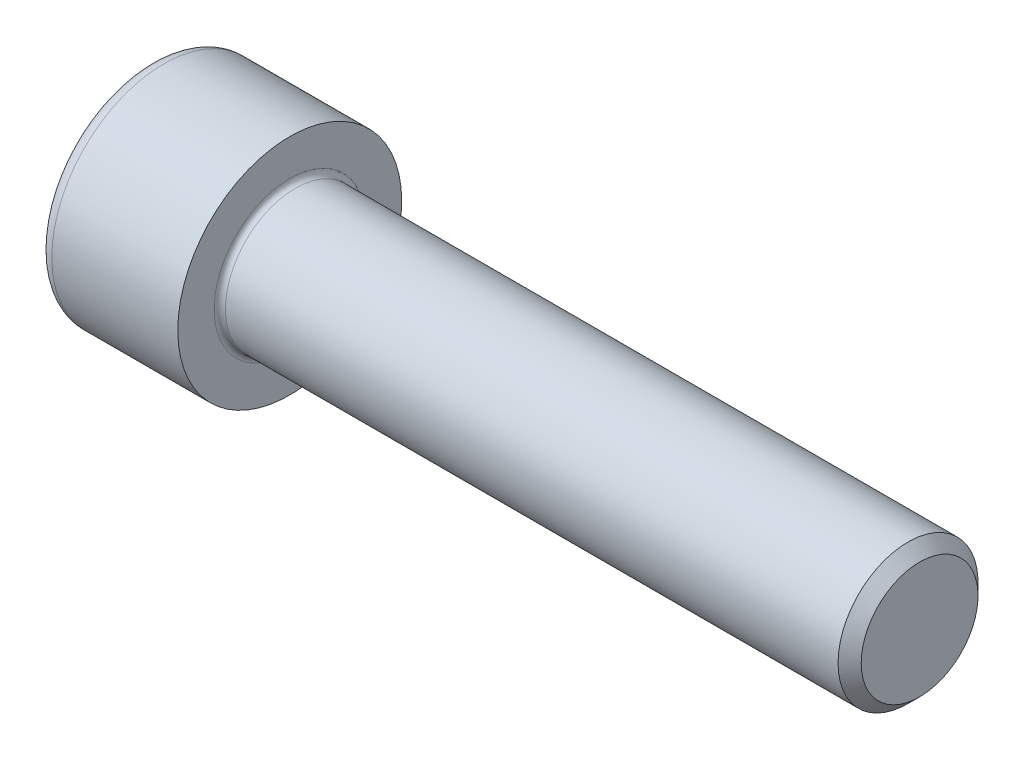
ISO-10303-21;
HEADER;
FILE_DESCRIPTION(('STEP AP214'),'2;1');
FILE_NAME('part.step','',(''),(''),'','','');
FILE_SCHEMA(('AUTOMOTIVE_DESIGN { 1 0 10303 214 1 1 1 1 }'));
ENDSEC;
DATA;
#1=APPLICATION_CONTEXT('core data for automotive mechanical design processes');
#2=APPLICATION_PROTOCOL_DEFINITION('international standard','automotive_design',2000,#1);
#3=PRODUCT_CONTEXT('',#1,'mechanical');
#4=PRODUCT('Part','Part','',(#3));
#5=PRODUCT_RELATED_PRODUCT_CATEGORY('part','',(#4));
#6=PRODUCT_DEFINITION_FORMATION('','',#4);
#7=PRODUCT_DEFINITION_CONTEXT('part definition',#1,'design');
#8=PRODUCT_DEFINITION('design','',#6,#7);
#9=PRODUCT_DEFINITION_SHAPE('','',#8);
#10=(LENGTH_UNIT() NAMED_UNIT(*) SI_UNIT(.MILLI.,.METRE.));
#11=(NAMED_UNIT(*) PLANE_ANGLE_UNIT() SI_UNIT($,.RADIAN.));
#12=(NAMED_UNIT(*) SI_UNIT($,.STERADIAN.) SOLID_ANGLE_UNIT());
#13=UNCERTAINTY_MEASURE_WITH_UNIT(LENGTH_MEASURE(1.E-05),#10,'distance_accuracy_value','');
#14=(GEOMETRIC_REPRESENTATION_CONTEXT(3) GLOBAL_UNCERTAINTY_ASSIGNED_CONTEXT((#13)) GLOBAL_UNIT_ASSIGNED_CONTEXT((#10,
#11,#12)) REPRESENTATION_CONTEXT('',''));
#15=CARTESIAN_POINT('',(0.,0.,0.));
#16=DIRECTION('',(0.,0.,1.));
#17=DIRECTION('',(1.,0.,0.));
#18=AXIS2_PLACEMENT_3D('',#15,#16,#17);
#19=CARTESIAN_POINT('',(0.,0.,0.));
#20=DIRECTION('',(-1.,0.,0.));
#21=DIRECTION('',(0.,0.,1.));
#22=AXIS2_PLACEMENT_3D('',#19,#20,#21);
#23=PLANE('',#22);
#24=DIRECTION('',(0.,-0.499999999999999,0.866025403784439));
#25=VECTOR('',#24,1.);
#26=CARTESIAN_POINT('',(0.,4.63323591024674,0.));
#27=LINE('',#26,#25);
#28=CARTESIAN_POINT('',(0.,4.63323591024674,0.));
#29=VERTEX_POINT('',#28);
#30=CARTESIAN_POINT('',(0.,2.31661795512337,4.0125));
#31=VERTEX_POINT('',#30);
#32=EDGE_CURVE('E265',#29,#31,#27,.T.);
#33=ORIENTED_EDGE('',*,*,#32,.T.);
#34=DIRECTION('',(0.,1.,0.));
#35=VECTOR('',#34,1.);
#36=CARTESIAN_POINT('',(0.,-2.31661795512337,4.0125));
#37=LINE('',#36,#35);
#38=CARTESIAN_POINT('',(0.,-2.31661795512337,4.0125));
#39=VERTEX_POINT('',#38);
#40=EDGE_CURVE('E126',#39,#31,#37,.T.);
#41=ORIENTED_EDGE('',*,*,#40,.F.);
#42=DIRECTION('',(0.,-0.500000000000001,-0.866025403784438));
#43=VECTOR('',#42,1.);
#44=CARTESIAN_POINT('',(0.,-2.31661795512337,4.0125));
#45=LINE('',#44,#43);
#46=CARTESIAN_POINT('',(0.,-4.63323591024675,0.));
#47=VERTEX_POINT('',#46);
#48=EDGE_CURVE('E268',#39,#47,#45,.T.);
#49=ORIENTED_EDGE('',*,*,#48,.T.);
#50=DIRECTION('',(0.,0.499999999999999,-0.866025403784439));
#51=VECTOR('',#50,1.);
#52=CARTESIAN_POINT('',(0.,-4.63323591024675,0.));
#53=LINE('',#52,#51);
#54=CARTESIAN_POINT('',(0.,-2.31661795512338,-4.0125));
#55=VERTEX_POINT('',#54);
#56=EDGE_CURVE('E271',#47,#55,#53,.T.);
#57=ORIENTED_EDGE('',*,*,#56,.T.);
#58=DIRECTION('',(0.,-1.,0.));
#59=VECTOR('',#58,1.);
#60=CARTESIAN_POINT('',(0.,2.31661795512336,-4.0125));
#61=LINE('',#60,#59);
#62=CARTESIAN_POINT('',(0.,2.31661795512336,-4.0125));
#63=VERTEX_POINT('',#62);
#64=EDGE_CURVE('E274',#63,#55,#61,.T.);
#65=ORIENTED_EDGE('',*,*,#64,.F.);
#66=DIRECTION('',(0.,-0.500000000000001,-0.866025403784438));
#67=VECTOR('',#66,1.);
#68=CARTESIAN_POINT('',(0.,4.63323591024674,0.));
#69=LINE('',#68,#67);
#70=EDGE_CURVE('E121',#29,#63,#69,.T.);
#71=ORIENTED_EDGE('',*,*,#70,.F.);
#72=EDGE_LOOP('',(#33,#41,#49,#57,#65,#71));
#73=FACE_BOUND('',#72,.T.);
#74=CARTESIAN_POINT('',(0.,0.,0.));
#75=DIRECTION('',(-1.,0.,0.));
#76=DIRECTION('',(0.,0.,1.));
#77=AXIS2_PLACEMENT_3D('',#74,#75,#76);
#78=CIRCLE('',#77,7.);
#79=CARTESIAN_POINT('',(0.,0.,7.));
#80=VERTEX_POINT('',#79);
#81=EDGE_CURVE('E42',#80,#80,#78,.T.);
#82=ORIENTED_EDGE('',*,*,#81,.T.);
#83=EDGE_LOOP('',(#82));
#84=FACE_BOUND('',#83,.T.);
#85=ADVANCED_FACE('F34',(#73,#84),#23,.T.);
#86=CARTESIAN_POINT('',(-31.75,0.,0.));
#87=DIRECTION('',(-1.,0.,0.));
#88=DIRECTION('',(0.,0.,1.));
#89=AXIS2_PLACEMENT_3D('',#86,#87,#88);
#90=CYLINDRICAL_SURFACE('',#89,8.);
#91=CARTESIAN_POINT('',(1.,0.,0.));
#92=DIRECTION('',(-1.,0.,0.));
#93=DIRECTION('',(0.,0.,1.));
#94=AXIS2_PLACEMENT_3D('',#91,#92,#93);
#95=CIRCLE('',#94,8.);
#96=CARTESIAN_POINT('',(1.,0.,8.));
#97=VERTEX_POINT('',#96);
#98=EDGE_CURVE('E11',#97,#97,#95,.F.);
#99=ORIENTED_EDGE('',*,*,#98,.T.);
#100=EDGE_LOOP('',(#99));
#101=FACE_BOUND('',#100,.T.);
#102=CARTESIAN_POINT('',(10.,0.,0.));
#103=DIRECTION('',(-1.,0.,0.));
#104=DIRECTION('',(0.,0.,1.));
#105=AXIS2_PLACEMENT_3D('',#102,#103,#104);
#106=CIRCLE('',#105,8.);
#107=CARTESIAN_POINT('',(10.,0.,8.));
#108=VERTEX_POINT('',#107);
#109=EDGE_CURVE('E144',#108,#108,#106,.T.);
#110=ORIENTED_EDGE('',*,*,#109,.T.);
#111=EDGE_LOOP('',(#110));
#112=FACE_BOUND('',#111,.T.);
#113=ADVANCED_FACE('F168',(#101,#112),#90,.T.);
#114=CARTESIAN_POINT('',(10.,8.,0.));
#115=DIRECTION('',(1.,0.,0.));
#116=DIRECTION('',(0.,0.,-1.));
#117=AXIS2_PLACEMENT_3D('',#114,#115,#116);
#118=PLANE('',#117);
#119=CARTESIAN_POINT('',(10.,0.,0.));
#120=DIRECTION('',(1.,0.,0.));
#121=DIRECTION('',(0.,0.,-1.));
#122=AXIS2_PLACEMENT_3D('',#119,#120,#121);
#123=CIRCLE('',#122,5.4);
#124=CARTESIAN_POINT('',(10.,0.,-5.4));
#125=VERTEX_POINT('',#124);
#126=EDGE_CURVE('E147',#125,#125,#123,.F.);
#127=ORIENTED_EDGE('',*,*,#126,.T.);
#128=EDGE_LOOP('',(#127));
#129=FACE_BOUND('',#128,.T.);
#130=ORIENTED_EDGE('',*,*,#109,.F.);
#131=EDGE_LOOP('',(#130));
#132=FACE_BOUND('',#131,.T.);
#133=ADVANCED_FACE('F174',(#129,#132),#118,.T.);
#134=CARTESIAN_POINT('',(-31.75,0.,0.));
#135=DIRECTION('',(-1.,0.,0.));
#136=DIRECTION('',(0.,0.,1.));
#137=AXIS2_PLACEMENT_3D('',#134,#135,#136);
#138=CYLINDRICAL_SURFACE('',#137,5.);
#139=CARTESIAN_POINT('',(10.4,0.,0.));
#140=DIRECTION('',(1.,0.,0.));
#141=DIRECTION('',(0.,0.,-1.));
#142=AXIS2_PLACEMENT_3D('',#139,#140,#141);
#143=CIRCLE('',#142,5.);
#144=CARTESIAN_POINT('',(10.4,0.,-5.));
#145=VERTEX_POINT('',#144);
#146=EDGE_CURVE('E150',#145,#145,#143,.T.);
#147=ORIENTED_EDGE('',*,*,#146,.T.);
#148=EDGE_LOOP('',(#147));
#149=FACE_BOUND('',#148,.T.);
#150=CARTESIAN_POINT('',(54.172,0.,0.));
#151=DIRECTION('',(-1.,0.,0.));
#152=DIRECTION('',(0.,0.,1.));
#153=AXIS2_PLACEMENT_3D('',#150,#151,#152);
#154=CIRCLE('',#153,5.);
#155=CARTESIAN_POINT('',(54.172,0.,5.));
#156=VERTEX_POINT('',#155);
#157=EDGE_CURVE('E141',#156,#156,#154,.T.);
#158=ORIENTED_EDGE('',*,*,#157,.T.);
#159=EDGE_LOOP('',(#158));
#160=FACE_BOUND('',#159,.T.);
#161=ADVANCED_FACE('F180',(#149,#160),#138,.T.);
#162=CARTESIAN_POINT('',(55.,0.,0.));
#163=DIRECTION('',(-1.,0.,0.));
#164=DIRECTION('',(0.,0.,1.));
#165=AXIS2_PLACEMENT_3D('',#162,#163,#164);
#166=CONICAL_SURFACE('',#165,4.172,0.785398163397434);
#167=ORIENTED_EDGE('',*,*,#157,.F.);
#168=EDGE_LOOP('',(#167));
#169=FACE_BOUND('',#168,.T.);
#170=CARTESIAN_POINT('',(55.,0.,0.));
#171=DIRECTION('',(-1.,0.,0.));
#172=DIRECTION('',(0.,0.,1.));
#173=AXIS2_PLACEMENT_3D('',#170,#171,#172);
#174=CIRCLE('',#173,4.172);
#175=CARTESIAN_POINT('',(55.,0.,4.172));
#176=VERTEX_POINT('',#175);
#177=EDGE_CURVE('E137',#176,#176,#174,.T.);
#178=ORIENTED_EDGE('',*,*,#177,.T.);
#179=EDGE_LOOP('',(#178));
#180=FACE_BOUND('',#179,.T.);
#181=ADVANCED_FACE('F184',(#169,#180),#166,.T.);
#182=CARTESIAN_POINT('',(55.,4.172,0.));
#183=DIRECTION('',(1.,0.,0.));
#184=DIRECTION('',(0.,0.,-1.));
#185=AXIS2_PLACEMENT_3D('',#182,#183,#184);
#186=PLANE('',#185);
#187=ORIENTED_EDGE('',*,*,#177,.F.);
#188=EDGE_LOOP('',(#187));
#189=FACE_BOUND('',#188,.T.);
#190=ADVANCED_FACE('F164',(#189),#186,.T.);
#191=CARTESIAN_POINT('',(10.4,0.,0.));
#192=DIRECTION('',(1.,0.,0.));
#193=DIRECTION('',(0.,0.,-1.));
#194=AXIS2_PLACEMENT_3D('',#191,#192,#193);
#195=TOROIDAL_SURFACE('',#194,5.4,0.4);
#196=ORIENTED_EDGE('',*,*,#146,.F.);
#197=EDGE_LOOP('',(#196));
#198=FACE_BOUND('',#197,.T.);
#199=ORIENTED_EDGE('',*,*,#126,.F.);
#200=EDGE_LOOP('',(#199));
#201=FACE_BOUND('',#200,.T.);
#202=ADVANCED_FACE('F157',(#198,#201),#195,.F.);
#203=CARTESIAN_POINT('',(1.,0.,0.));
#204=DIRECTION('',(-1.,0.,0.));
#205=DIRECTION('',(0.,0.,1.));
#206=AXIS2_PLACEMENT_3D('',#203,#204,#205);
#207=TOROIDAL_SURFACE('',#206,7.,1.);
#208=ORIENTED_EDGE('',*,*,#98,.F.);
#209=EDGE_LOOP('',(#208));
#210=FACE_BOUND('',#209,.T.);
#211=ORIENTED_EDGE('',*,*,#81,.F.);
#212=EDGE_LOOP('',(#211));
#213=FACE_BOUND('',#212,.T.);
#214=ADVANCED_FACE('F36',(#210,#213),#207,.T.);
#215=CARTESIAN_POINT('',(5.,4.63323591024674,0.));
#216=DIRECTION('',(0.,-0.866025403784439,-0.499999999999999));
#217=DIRECTION('',(0.,0.499999999999999,-0.866025403784439));
#218=AXIS2_PLACEMENT_3D('',#215,#216,#217);
#219=PLANE('',#218);
#220=ORIENTED_EDGE('',*,*,#32,.F.);
#221=DIRECTION('',(-1.,0.,0.));
#222=VECTOR('',#221,1.);
#223=CARTESIAN_POINT('',(5.,4.63323591024674,0.));
#224=LINE('',#223,#222);
#225=CARTESIAN_POINT('',(5.,4.63323591024674,0.));
#226=VERTEX_POINT('',#225);
#227=EDGE_CURVE('E264',#226,#29,#224,.T.);
#228=ORIENTED_EDGE('',*,*,#227,.F.);
#229=DIRECTION('',(0.,-0.499999999999999,0.866025403784439));
#230=VECTOR('',#229,1.);
#231=CARTESIAN_POINT('',(5.,4.63323591024674,0.));
#232=LINE('',#231,#230);
#233=CARTESIAN_POINT('',(5.,3.47492693268506,2.00624999999999));
#234=VERTEX_POINT('',#233);
#235=EDGE_CURVE('E49',#226,#234,#232,.T.);
#236=ORIENTED_EDGE('',*,*,#235,.T.);
#237=CARTESIAN_POINT('',(5.,2.31661795512337,4.0125));
#238=VERTEX_POINT('',#237);
#239=EDGE_CURVE('E107',#234,#238,#232,.T.);
#240=ORIENTED_EDGE('',*,*,#239,.T.);
#241=DIRECTION('',(-1.,0.,0.));
#242=VECTOR('',#241,1.);
#243=CARTESIAN_POINT('',(5.,2.31661795512337,4.0125));
#244=LINE('',#243,#242);
#245=EDGE_CURVE('E119',#238,#31,#244,.T.);
#246=ORIENTED_EDGE('',*,*,#245,.T.);
#247=EDGE_LOOP('',(#220,#228,#236,#240,#246));
#248=FACE_BOUND('',#247,.T.);
#249=ADVANCED_FACE('F118',(#248),#219,.T.);
#250=CARTESIAN_POINT('',(5.,-2.31661795512337,4.0125));
#251=DIRECTION('',(0.,0.,1.));
#252=DIRECTION('',(0.,-1.,0.));
#253=AXIS2_PLACEMENT_3D('',#250,#251,#252);
#254=PLANE('',#253);
#255=ORIENTED_EDGE('',*,*,#40,.T.);
#256=ORIENTED_EDGE('',*,*,#245,.F.);
#257=DIRECTION('',(0.,1.,0.));
#258=VECTOR('',#257,1.);
#259=CARTESIAN_POINT('',(5.,-2.31661795512337,4.0125));
#260=LINE('',#259,#258);
#261=CARTESIAN_POINT('',(5.,0.,4.0125));
#262=VERTEX_POINT('',#261);
#263=EDGE_CURVE('E105',#262,#238,#260,.T.);
#264=ORIENTED_EDGE('',*,*,#263,.F.);
#265=CARTESIAN_POINT('',(5.,-2.31661795512337,4.0125));
#266=VERTEX_POINT('',#265);
#267=EDGE_CURVE('E115',#266,#262,#260,.T.);
#268=ORIENTED_EDGE('',*,*,#267,.F.);
#269=DIRECTION('',(-1.,0.,0.));
#270=VECTOR('',#269,1.);
#271=CARTESIAN_POINT('',(5.,-2.31661795512337,4.0125));
#272=LINE('',#271,#270);
#273=EDGE_CURVE('E128',#266,#39,#272,.T.);
#274=ORIENTED_EDGE('',*,*,#273,.T.);
#275=EDGE_LOOP('',(#255,#256,#264,#268,#274));
#276=FACE_BOUND('',#275,.T.);
#277=ADVANCED_FACE('F123',(#276),#254,.F.);
#278=CARTESIAN_POINT('',(5.,-2.31661795512337,4.0125));
#279=DIRECTION('',(0.,0.866025403784438,-0.500000000000001));
#280=DIRECTION('',(0.,0.500000000000001,0.866025403784438));
#281=AXIS2_PLACEMENT_3D('',#278,#279,#280);
#282=PLANE('',#281);
#283=ORIENTED_EDGE('',*,*,#48,.F.);
#284=ORIENTED_EDGE('',*,*,#273,.F.);
#285=DIRECTION('',(0.,-0.500000000000001,-0.866025403784438));
#286=VECTOR('',#285,1.);
#287=CARTESIAN_POINT('',(5.,-2.31661795512337,4.0125));
#288=LINE('',#287,#286);
#289=CARTESIAN_POINT('',(5.,-3.47492693268506,2.00625000000001));
#290=VERTEX_POINT('',#289);
#291=EDGE_CURVE('E245',#266,#290,#288,.T.);
#292=ORIENTED_EDGE('',*,*,#291,.T.);
#293=CARTESIAN_POINT('',(5.,-4.63323591024675,0.));
#294=VERTEX_POINT('',#293);
#295=EDGE_CURVE('E247',#290,#294,#288,.T.);
#296=ORIENTED_EDGE('',*,*,#295,.T.);
#297=DIRECTION('',(-1.,0.,0.));
#298=VECTOR('',#297,1.);
#299=CARTESIAN_POINT('',(5.,-4.63323591024675,0.));
#300=LINE('',#299,#298);
#301=EDGE_CURVE('E133',#294,#47,#300,.T.);
#302=ORIENTED_EDGE('',*,*,#301,.T.);
#303=EDGE_LOOP('',(#283,#284,#292,#296,#302));
#304=FACE_BOUND('',#303,.T.);
#305=ADVANCED_FACE('F197',(#304),#282,.T.);
#306=CARTESIAN_POINT('',(5.,-4.63323591024675,0.));
#307=DIRECTION('',(0.,0.866025403784439,0.499999999999999));
#308=DIRECTION('',(0.,-0.499999999999999,0.866025403784439));
#309=AXIS2_PLACEMENT_3D('',#306,#307,#308);
#310=PLANE('',#309);
#311=ORIENTED_EDGE('',*,*,#56,.F.);
#312=ORIENTED_EDGE('',*,*,#301,.F.);
#313=DIRECTION('',(0.,0.499999999999999,-0.866025403784439));
#314=VECTOR('',#313,1.);
#315=CARTESIAN_POINT('',(5.,-4.63323591024675,0.));
#316=LINE('',#315,#314);
#317=CARTESIAN_POINT('',(5.,-3.47492693268507,-2.00625));
#318=VERTEX_POINT('',#317);
#319=EDGE_CURVE('E250',#294,#318,#316,.T.);
#320=ORIENTED_EDGE('',*,*,#319,.T.);
#321=CARTESIAN_POINT('',(5.,-2.31661795512338,-4.0125));
#322=VERTEX_POINT('',#321);
#323=EDGE_CURVE('E254',#318,#322,#316,.T.);
#324=ORIENTED_EDGE('',*,*,#323,.T.);
#325=DIRECTION('',(-1.,0.,0.));
#326=VECTOR('',#325,1.);
#327=CARTESIAN_POINT('',(5.,-2.31661795512338,-4.0125));
#328=LINE('',#327,#326);
#329=EDGE_CURVE('E283',#322,#55,#328,.T.);
#330=ORIENTED_EDGE('',*,*,#329,.T.);
#331=EDGE_LOOP('',(#311,#312,#320,#324,#330));
#332=FACE_BOUND('',#331,.T.);
#333=ADVANCED_FACE('F200',(#332),#310,.T.);
#334=CARTESIAN_POINT('',(5.,2.31661795512336,-4.0125));
#335=DIRECTION('',(0.,0.,-1.));
#336=DIRECTION('',(0.,1.,0.));
#337=AXIS2_PLACEMENT_3D('',#334,#335,#336);
#338=PLANE('',#337);
#339=ORIENTED_EDGE('',*,*,#64,.T.);
#340=ORIENTED_EDGE('',*,*,#329,.F.);
#341=DIRECTION('',(0.,-1.,0.));
#342=VECTOR('',#341,1.);
#343=CARTESIAN_POINT('',(5.,2.31661795512336,-4.0125));
#344=LINE('',#343,#342);
#345=CARTESIAN_POINT('',(5.,0.,-4.0125));
#346=VERTEX_POINT('',#345);
#347=EDGE_CURVE('E258',#346,#322,#344,.T.);
#348=ORIENTED_EDGE('',*,*,#347,.F.);
#349=CARTESIAN_POINT('',(5.,2.31661795512336,-4.0125));
#350=VERTEX_POINT('',#349);
#351=EDGE_CURVE('E259',#350,#346,#344,.T.);
#352=ORIENTED_EDGE('',*,*,#351,.F.);
#353=DIRECTION('',(-1.,0.,0.));
#354=VECTOR('',#353,1.);
#355=CARTESIAN_POINT('',(5.,2.31661795512336,-4.0125));
#356=LINE('',#355,#354);
#357=EDGE_CURVE('E280',#350,#63,#356,.T.);
#358=ORIENTED_EDGE('',*,*,#357,.T.);
#359=EDGE_LOOP('',(#339,#340,#348,#352,#358));
#360=FACE_BOUND('',#359,.T.);
#361=ADVANCED_FACE('F204',(#360),#338,.F.);
#362=CARTESIAN_POINT('',(5.,4.63323591024674,0.));
#363=DIRECTION('',(0.,0.866025403784438,-0.500000000000001));
#364=DIRECTION('',(0.,0.500000000000001,0.866025403784438));
#365=AXIS2_PLACEMENT_3D('',#362,#363,#364);
#366=PLANE('',#365);
#367=ORIENTED_EDGE('',*,*,#70,.T.);
#368=ORIENTED_EDGE('',*,*,#357,.F.);
#369=DIRECTION('',(0.,-0.500000000000001,-0.866025403784438));
#370=VECTOR('',#369,1.);
#371=CARTESIAN_POINT('',(5.,4.63323591024674,0.));
#372=LINE('',#371,#370);
#373=CARTESIAN_POINT('',(5.,3.47492693268505,-2.00625));
#374=VERTEX_POINT('',#373);
#375=EDGE_CURVE('E262',#374,#350,#372,.T.);
#376=ORIENTED_EDGE('',*,*,#375,.F.);
#377=EDGE_CURVE('E236',#226,#374,#372,.T.);
#378=ORIENTED_EDGE('',*,*,#377,.F.);
#379=ORIENTED_EDGE('',*,*,#227,.T.);
#380=EDGE_LOOP('',(#367,#368,#376,#378,#379));
#381=FACE_BOUND('',#380,.T.);
#382=ADVANCED_FACE('F208',(#381),#366,.F.);
#383=CARTESIAN_POINT('',(5.,2.31661795512337,4.0125));
#384=DIRECTION('',(-1.,0.,0.));
#385=DIRECTION('',(0.,0.,1.));
#386=AXIS2_PLACEMENT_3D('',#383,#384,#385);
#387=PLANE('',#386);
#388=CARTESIAN_POINT('',(5.,0.,0.));
#389=DIRECTION('',(-1.,0.,0.));
#390=DIRECTION('',(0.,0.,1.));
#391=AXIS2_PLACEMENT_3D('',#388,#389,#390);
#392=CIRCLE('',#391,4.0125);
#393=EDGE_CURVE('E127',#290,#262,#392,.T.);
#394=ORIENTED_EDGE('',*,*,#393,.F.);
#395=ORIENTED_EDGE('',*,*,#291,.F.);
#396=ORIENTED_EDGE('',*,*,#267,.T.);
#397=EDGE_LOOP('',(#394,#395,#396));
#398=FACE_BOUND('',#397,.T.);
#399=ADVANCED_FACE('F212',(#398),#387,.T.);
#400=EDGE_CURVE('E131',#318,#290,#392,.T.);
#401=ORIENTED_EDGE('',*,*,#400,.F.);
#402=ORIENTED_EDGE('',*,*,#319,.F.);
#403=ORIENTED_EDGE('',*,*,#295,.F.);
#404=EDGE_LOOP('',(#401,#402,#403));
#405=FACE_BOUND('',#404,.T.);
#406=ADVANCED_FACE('F215',(#405),#387,.T.);
#407=EDGE_CURVE('E289',#346,#318,#392,.T.);
#408=ORIENTED_EDGE('',*,*,#407,.F.);
#409=ORIENTED_EDGE('',*,*,#347,.T.);
#410=ORIENTED_EDGE('',*,*,#323,.F.);
#411=EDGE_LOOP('',(#408,#409,#410));
#412=FACE_BOUND('',#411,.T.);
#413=ADVANCED_FACE('F220',(#412),#387,.T.);
#414=EDGE_CURVE('E239',#374,#346,#392,.T.);
#415=ORIENTED_EDGE('',*,*,#414,.F.);
#416=ORIENTED_EDGE('',*,*,#375,.T.);
#417=ORIENTED_EDGE('',*,*,#351,.T.);
#418=EDGE_LOOP('',(#415,#416,#417));
#419=FACE_BOUND('',#418,.T.);
#420=ADVANCED_FACE('F227',(#419),#387,.T.);
#421=EDGE_CURVE('E138',#234,#374,#392,.T.);
#422=ORIENTED_EDGE('',*,*,#421,.F.);
#423=ORIENTED_EDGE('',*,*,#235,.F.);
#424=ORIENTED_EDGE('',*,*,#377,.T.);
#425=EDGE_LOOP('',(#422,#423,#424));
#426=FACE_BOUND('',#425,.T.);
#427=ADVANCED_FACE('F223',(#426),#387,.T.);
#428=EDGE_CURVE('E110',#262,#234,#392,.T.);
#429=ORIENTED_EDGE('',*,*,#428,.F.);
#430=ORIENTED_EDGE('',*,*,#263,.T.);
#431=ORIENTED_EDGE('',*,*,#239,.F.);
#432=EDGE_LOOP('',(#429,#430,#431));
#433=FACE_BOUND('',#432,.T.);
#434=ADVANCED_FACE('F106',(#433),#387,.T.);
#435=CARTESIAN_POINT('',(5.,0.,0.));
#436=DIRECTION('',(-1.,0.,0.));
#437=DIRECTION('',(0.,0.,1.));
#438=AXIS2_PLACEMENT_3D('',#435,#436,#437);
#439=CONICAL_SURFACE('',#438,4.0125,1.04719755119659);
#440=CARTESIAN_POINT('',(7.31661795512339,0.,0.));
#441=VERTEX_POINT('',#440);
#442=VERTEX_LOOP('',#441);
#443=FACE_BOUND('',#442,.T.);
#444=ORIENTED_EDGE('',*,*,#428,.T.);
#445=ORIENTED_EDGE('',*,*,#421,.T.);
#446=ORIENTED_EDGE('',*,*,#414,.T.);
#447=ORIENTED_EDGE('',*,*,#407,.T.);
#448=ORIENTED_EDGE('',*,*,#400,.T.);
#449=ORIENTED_EDGE('',*,*,#393,.T.);
#450=EDGE_LOOP('',(#444,#445,#446,#447,#448,#449));
#451=FACE_BOUND('',#450,.T.);
#452=ADVANCED_FACE('F192',(#443,#451),#439,.F.);
#453=CLOSED_SHELL('',(#85,#113,#133,#161,#181,#190,#202,#214,#249,#277,#305,#333,#361,#382,#399,
#406,#413,#420,#427,#434,#452));
#454=MANIFOLD_SOLID_BREP('B2',#453);
#455=ADVANCED_BREP_SHAPE_REPRESENTATION('',(#18,#454),#14);
#456=SHAPE_DEFINITION_REPRESENTATION(#9,#455);
ENDSEC;
END-ISO-10303-21;
